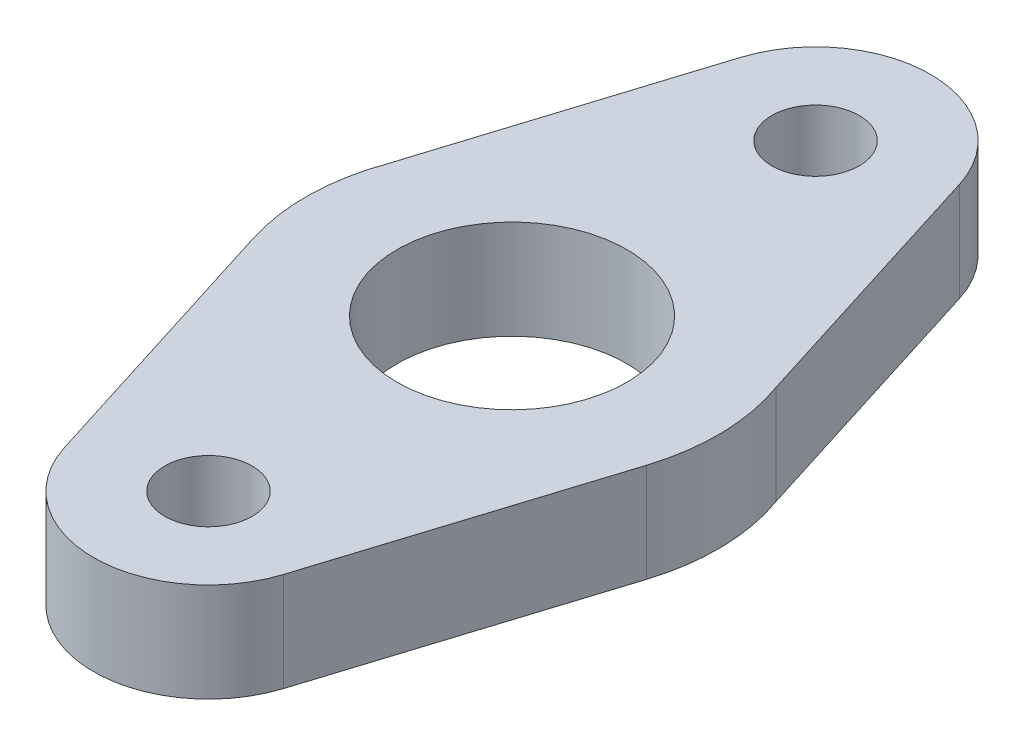
ISO-10303-21;
HEADER;
FILE_DESCRIPTION(('STEP AP214'),'2;1');
FILE_NAME('part.step','',(''),(''),'','','');
FILE_SCHEMA(('AUTOMOTIVE_DESIGN { 1 0 10303 214 1 1 1 1 }'));
ENDSEC;
DATA;
#1=APPLICATION_CONTEXT('core data for automotive mechanical design processes');
#2=APPLICATION_PROTOCOL_DEFINITION('international standard','automotive_design',2000,#1);
#3=PRODUCT_CONTEXT('',#1,'mechanical');
#4=PRODUCT('Part','Part','',(#3));
#5=PRODUCT_RELATED_PRODUCT_CATEGORY('part','',(#4));
#6=PRODUCT_DEFINITION_FORMATION('','',#4);
#7=PRODUCT_DEFINITION_CONTEXT('part definition',#1,'design');
#8=PRODUCT_DEFINITION('design','',#6,#7);
#9=PRODUCT_DEFINITION_SHAPE('','',#8);
#10=(LENGTH_UNIT() NAMED_UNIT(*) SI_UNIT(.MILLI.,.METRE.));
#11=(NAMED_UNIT(*) PLANE_ANGLE_UNIT() SI_UNIT($,.RADIAN.));
#12=(NAMED_UNIT(*) SI_UNIT($,.STERADIAN.) SOLID_ANGLE_UNIT());
#13=UNCERTAINTY_MEASURE_WITH_UNIT(LENGTH_MEASURE(1.E-05),#10,'distance_accuracy_value','');
#14=(GEOMETRIC_REPRESENTATION_CONTEXT(3) GLOBAL_UNCERTAINTY_ASSIGNED_CONTEXT((#13)) GLOBAL_UNIT_ASSIGNED_CONTEXT((#10,
#11,#12)) REPRESENTATION_CONTEXT('',''));
#15=CARTESIAN_POINT('',(0.,0.,0.));
#16=DIRECTION('',(0.,0.,1.));
#17=DIRECTION('',(1.,0.,0.));
#18=AXIS2_PLACEMENT_3D('',#15,#16,#17);
#19=CARTESIAN_POINT('',(75.7144117647058,80.772,33.528));
#20=DIRECTION('',(0.,1.,0.));
#21=DIRECTION('',(0.,0.,1.));
#22=AXIS2_PLACEMENT_3D('',#19,#20,#21);
#23=PLANE('',#22);
#24=CARTESIAN_POINT('',(75.7144117647058,80.772,-33.528));
#25=DIRECTION('',(0.,1.,0.));
#26=DIRECTION('',(0.,0.,1.));
#27=AXIS2_PLACEMENT_3D('',#24,#25,#26);
#28=CIRCLE('',#27,4.82599999999999);
#29=CARTESIAN_POINT('',(75.7144117647058,80.772,-28.702));
#30=VERTEX_POINT('',#29);
#31=EDGE_CURVE('E219',#30,#30,#28,.T.);
#32=ORIENTED_EDGE('',*,*,#31,.F.);
#33=EDGE_LOOP('',(#32));
#34=FACE_BOUND('',#33,.T.);
#35=CARTESIAN_POINT('',(75.7144117647058,80.772,33.528));
#36=DIRECTION('',(0.,1.,0.));
#37=DIRECTION('',(0.,0.,1.));
#38=AXIS2_PLACEMENT_3D('',#35,#36,#37);
#39=CIRCLE('',#38,12.7);
#40=CARTESIAN_POINT('',(63.6010012150996,80.772,37.3431389039835));
#41=VERTEX_POINT('',#40);
#42=CARTESIAN_POINT('',(87.8278223143121,80.772,37.3431389039835));
#43=VERTEX_POINT('',#42);
#44=EDGE_CURVE('E170',#41,#43,#39,.T.);
#45=ORIENTED_EDGE('',*,*,#44,.T.);
#46=DIRECTION('',(0.300404638108933,0.,-0.953811854299705));
#47=VECTOR('',#46,1.);
#48=CARTESIAN_POINT('',(87.8278223143121,80.772,37.3431389039835));
#49=LINE('',#48,#47);
#50=CARTESIAN_POINT('',(97.4345835550993,80.772,6.84080441749971));
#51=VERTEX_POINT('',#50);
#52=EDGE_CURVE('E106',#43,#51,#49,.T.);
#53=ORIENTED_EDGE('',*,*,#52,.T.);
#54=CARTESIAN_POINT('',(75.7144117647058,80.772,0.));
#55=DIRECTION('',(0.,1.,0.));
#56=DIRECTION('',(0.,0.,1.));
#57=AXIS2_PLACEMENT_3D('',#54,#55,#56);
#58=CIRCLE('',#57,22.7719667065163);
#59=CARTESIAN_POINT('',(97.1130608396016,80.772,-7.78847131676994));
#60=VERTEX_POINT('',#59);
#61=EDGE_CURVE('E191',#51,#60,#58,.T.);
#62=ORIENTED_EDGE('',*,*,#61,.T.);
#63=DIRECTION('',(-0.299727454331751,0.,-0.954024870283688));
#64=VECTOR('',#63,1.);
#65=CARTESIAN_POINT('',(97.1130608396016,80.772,-7.78847131676994));
#66=LINE('',#65,#64);
#67=CARTESIAN_POINT('',(87.8305276173087,80.772,-37.3345386700132));
#68=VERTEX_POINT('',#67);
#69=EDGE_CURVE('E205',#60,#68,#66,.T.);
#70=ORIENTED_EDGE('',*,*,#69,.T.);
#71=CARTESIAN_POINT('',(75.7144117647058,80.772,-33.528));
#72=DIRECTION('',(0.,1.,0.));
#73=DIRECTION('',(0.,0.,1.));
#74=AXIS2_PLACEMENT_3D('',#71,#72,#73);
#75=CIRCLE('',#74,12.7);
#76=CARTESIAN_POINT('',(63.598295912103,80.772,-37.3345386700132));
#77=VERTEX_POINT('',#76);
#78=EDGE_CURVE('E125',#68,#77,#75,.T.);
#79=ORIENTED_EDGE('',*,*,#78,.T.);
#80=DIRECTION('',(-0.29972745433175,0.,0.954024870283688));
#81=VECTOR('',#80,1.);
#82=CARTESIAN_POINT('',(63.598295912103,80.772,-37.3345386700132));
#83=LINE('',#82,#81);
#84=CARTESIAN_POINT('',(54.31576268981,80.772,-7.78847131676994));
#85=VERTEX_POINT('',#84);
#86=EDGE_CURVE('E119',#77,#85,#83,.T.);
#87=ORIENTED_EDGE('',*,*,#86,.T.);
#88=CARTESIAN_POINT('',(75.7144117647058,80.772,0.));
#89=DIRECTION('',(0.,1.,0.));
#90=DIRECTION('',(0.,0.,1.));
#91=AXIS2_PLACEMENT_3D('',#88,#89,#90);
#92=CIRCLE('',#91,22.7719667065163);
#93=CARTESIAN_POINT('',(53.9942399743124,80.772,6.84080441749969));
#94=VERTEX_POINT('',#93);
#95=EDGE_CURVE('E123',#85,#94,#92,.T.);
#96=ORIENTED_EDGE('',*,*,#95,.T.);
#97=DIRECTION('',(0.300404638108933,0.,0.953811854299705));
#98=VECTOR('',#97,1.);
#99=CARTESIAN_POINT('',(53.9942399743124,80.772,6.84080441749969));
#100=LINE('',#99,#98);
#101=EDGE_CURVE('E63',#94,#41,#100,.T.);
#102=ORIENTED_EDGE('',*,*,#101,.T.);
#103=EDGE_LOOP('',(#45,#53,#62,#70,#79,#87,#96,#102));
#104=FACE_BOUND('',#103,.T.);
#105=CARTESIAN_POINT('',(75.7144117647058,80.772,33.528));
#106=DIRECTION('',(0.,1.,0.));
#107=DIRECTION('',(0.,0.,1.));
#108=AXIS2_PLACEMENT_3D('',#105,#106,#107);
#109=CIRCLE('',#108,4.82599999999999);
#110=CARTESIAN_POINT('',(75.7144117647058,80.772,38.354));
#111=VERTEX_POINT('',#110);
#112=EDGE_CURVE('E152',#111,#111,#109,.T.);
#113=ORIENTED_EDGE('',*,*,#112,.F.);
#114=EDGE_LOOP('',(#113));
#115=FACE_BOUND('',#114,.T.);
#116=CARTESIAN_POINT('',(75.7144117647058,80.772,0.));
#117=DIRECTION('',(0.,1.,0.));
#118=DIRECTION('',(0.,0.,1.));
#119=AXIS2_PLACEMENT_3D('',#116,#117,#118);
#120=CIRCLE('',#119,12.7);
#121=CARTESIAN_POINT('',(75.7144117647058,80.772,12.7));
#122=VERTEX_POINT('',#121);
#123=EDGE_CURVE('E227',#122,#122,#120,.T.);
#124=ORIENTED_EDGE('',*,*,#123,.F.);
#125=EDGE_LOOP('',(#124));
#126=FACE_BOUND('',#125,.T.);
#127=ADVANCED_FACE('F45',(#34,#104,#115,#126),#23,.T.);
#128=CARTESIAN_POINT('',(75.7144117647058,69.85,33.528));
#129=DIRECTION('',(0.,1.,0.));
#130=DIRECTION('',(0.,0.,1.));
#131=AXIS2_PLACEMENT_3D('',#128,#129,#130);
#132=PLANE('',#131);
#133=CARTESIAN_POINT('',(75.7144117647058,69.85,33.528));
#134=DIRECTION('',(0.,1.,0.));
#135=DIRECTION('',(0.,0.,1.));
#136=AXIS2_PLACEMENT_3D('',#133,#134,#135);
#137=CIRCLE('',#136,12.7);
#138=CARTESIAN_POINT('',(63.6010012150996,69.85,37.3431389039835));
#139=VERTEX_POINT('',#138);
#140=CARTESIAN_POINT('',(87.8278223143121,69.85,37.3431389039835));
#141=VERTEX_POINT('',#140);
#142=EDGE_CURVE('E147',#139,#141,#137,.T.);
#143=ORIENTED_EDGE('',*,*,#142,.F.);
#144=DIRECTION('',(0.300404638108933,0.,0.953811854299705));
#145=VECTOR('',#144,1.);
#146=CARTESIAN_POINT('',(53.9942399743124,69.85,6.84080441749969));
#147=LINE('',#146,#145);
#148=CARTESIAN_POINT('',(53.9942399743124,69.85,6.84080441749969));
#149=VERTEX_POINT('',#148);
#150=EDGE_CURVE('E98',#149,#139,#147,.T.);
#151=ORIENTED_EDGE('',*,*,#150,.F.);
#152=CARTESIAN_POINT('',(75.7144117647058,69.85,0.));
#153=DIRECTION('',(0.,1.,0.));
#154=DIRECTION('',(0.,0.,1.));
#155=AXIS2_PLACEMENT_3D('',#152,#153,#154);
#156=CIRCLE('',#155,22.7719667065163);
#157=CARTESIAN_POINT('',(54.31576268981,69.85,-7.78847131676994));
#158=VERTEX_POINT('',#157);
#159=EDGE_CURVE('E92',#158,#149,#156,.T.);
#160=ORIENTED_EDGE('',*,*,#159,.F.);
#161=DIRECTION('',(-0.29972745433175,0.,0.954024870283688));
#162=VECTOR('',#161,1.);
#163=CARTESIAN_POINT('',(63.598295912103,69.85,-37.3345386700132));
#164=LINE('',#163,#162);
#165=CARTESIAN_POINT('',(63.598295912103,69.85,-37.3345386700132));
#166=VERTEX_POINT('',#165);
#167=EDGE_CURVE('E134',#166,#158,#164,.T.);
#168=ORIENTED_EDGE('',*,*,#167,.F.);
#169=CARTESIAN_POINT('',(75.7144117647058,69.85,-33.528));
#170=DIRECTION('',(0.,1.,0.));
#171=DIRECTION('',(0.,0.,1.));
#172=AXIS2_PLACEMENT_3D('',#169,#170,#171);
#173=CIRCLE('',#172,12.7);
#174=CARTESIAN_POINT('',(87.8305276173087,69.85,-37.3345386700132));
#175=VERTEX_POINT('',#174);
#176=EDGE_CURVE('E161',#175,#166,#173,.T.);
#177=ORIENTED_EDGE('',*,*,#176,.F.);
#178=DIRECTION('',(-0.299727454331751,0.,-0.954024870283688));
#179=VECTOR('',#178,1.);
#180=CARTESIAN_POINT('',(97.1130608396016,69.85,-7.78847131676994));
#181=LINE('',#180,#179);
#182=CARTESIAN_POINT('',(97.1130608396016,69.85,-7.78847131676994));
#183=VERTEX_POINT('',#182);
#184=EDGE_CURVE('E158',#183,#175,#181,.T.);
#185=ORIENTED_EDGE('',*,*,#184,.F.);
#186=CARTESIAN_POINT('',(75.7144117647058,69.85,0.));
#187=DIRECTION('',(0.,1.,0.));
#188=DIRECTION('',(0.,0.,1.));
#189=AXIS2_PLACEMENT_3D('',#186,#187,#188);
#190=CIRCLE('',#189,22.7719667065163);
#191=CARTESIAN_POINT('',(97.4345835550993,69.85,6.84080441749971));
#192=VERTEX_POINT('',#191);
#193=EDGE_CURVE('E155',#192,#183,#190,.T.);
#194=ORIENTED_EDGE('',*,*,#193,.F.);
#195=DIRECTION('',(0.300404638108933,0.,-0.953811854299705));
#196=VECTOR('',#195,1.);
#197=CARTESIAN_POINT('',(87.8278223143121,69.85,37.3431389039835));
#198=LINE('',#197,#196);
#199=EDGE_CURVE('E151',#141,#192,#198,.T.);
#200=ORIENTED_EDGE('',*,*,#199,.F.);
#201=EDGE_LOOP('',(#143,#151,#160,#168,#177,#185,#194,#200));
#202=FACE_BOUND('',#201,.T.);
#203=CARTESIAN_POINT('',(75.7144117647058,69.85,33.528));
#204=DIRECTION('',(0.,1.,0.));
#205=DIRECTION('',(0.,0.,1.));
#206=AXIS2_PLACEMENT_3D('',#203,#204,#205);
#207=CIRCLE('',#206,4.82599999999999);
#208=CARTESIAN_POINT('',(75.7144117647058,69.85,38.354));
#209=VERTEX_POINT('',#208);
#210=EDGE_CURVE('E215',#209,#209,#207,.T.);
#211=ORIENTED_EDGE('',*,*,#210,.T.);
#212=EDGE_LOOP('',(#211));
#213=FACE_BOUND('',#212,.T.);
#214=CARTESIAN_POINT('',(75.7144117647058,69.85,-33.528));
#215=DIRECTION('',(0.,1.,0.));
#216=DIRECTION('',(0.,0.,1.));
#217=AXIS2_PLACEMENT_3D('',#214,#215,#216);
#218=CIRCLE('',#217,4.82599999999999);
#219=CARTESIAN_POINT('',(75.7144117647058,69.85,-28.702));
#220=VERTEX_POINT('',#219);
#221=EDGE_CURVE('E223',#220,#220,#218,.T.);
#222=ORIENTED_EDGE('',*,*,#221,.T.);
#223=EDGE_LOOP('',(#222));
#224=FACE_BOUND('',#223,.T.);
#225=CARTESIAN_POINT('',(75.7144117647058,69.85,0.));
#226=DIRECTION('',(0.,1.,0.));
#227=DIRECTION('',(0.,0.,1.));
#228=AXIS2_PLACEMENT_3D('',#225,#226,#227);
#229=CIRCLE('',#228,12.7);
#230=CARTESIAN_POINT('',(75.7144117647058,69.85,12.7));
#231=VERTEX_POINT('',#230);
#232=EDGE_CURVE('E231',#231,#231,#229,.T.);
#233=ORIENTED_EDGE('',*,*,#232,.T.);
#234=EDGE_LOOP('',(#233));
#235=FACE_BOUND('',#234,.T.);
#236=ADVANCED_FACE('F195',(#202,#213,#224,#235),#132,.F.);
#237=CARTESIAN_POINT('',(75.7144117647058,80.772,33.528));
#238=DIRECTION('',(0.,-1.,0.));
#239=DIRECTION('',(0.,0.,-1.));
#240=AXIS2_PLACEMENT_3D('',#237,#238,#239);
#241=CYLINDRICAL_SURFACE('',#240,12.7);
#242=ORIENTED_EDGE('',*,*,#142,.T.);
#243=DIRECTION('',(0.,-1.,0.));
#244=VECTOR('',#243,1.);
#245=CARTESIAN_POINT('',(87.8278223143121,80.772,37.3431389039835));
#246=LINE('',#245,#244);
#247=EDGE_CURVE('E11',#43,#141,#246,.T.);
#248=ORIENTED_EDGE('',*,*,#247,.F.);
#249=ORIENTED_EDGE('',*,*,#44,.F.);
#250=DIRECTION('',(0.,-1.,0.));
#251=VECTOR('',#250,1.);
#252=CARTESIAN_POINT('',(63.6010012150996,80.772,37.3431389039835));
#253=LINE('',#252,#251);
#254=EDGE_CURVE('E143',#41,#139,#253,.T.);
#255=ORIENTED_EDGE('',*,*,#254,.T.);
#256=EDGE_LOOP('',(#242,#248,#249,#255));
#257=FACE_BOUND('',#256,.T.);
#258=ADVANCED_FACE('F47',(#257),#241,.T.);
#259=CARTESIAN_POINT('',(87.8278223143121,80.772,37.3431389039835));
#260=DIRECTION('',(-0.953811854299705,0.,-0.300404638108933));
#261=DIRECTION('',(-0.300404638108933,0.,0.953811854299705));
#262=AXIS2_PLACEMENT_3D('',#259,#260,#261);
#263=PLANE('',#262);
#264=ORIENTED_EDGE('',*,*,#199,.T.);
#265=DIRECTION('',(0.,-1.,0.));
#266=VECTOR('',#265,1.);
#267=CARTESIAN_POINT('',(97.4345835550993,80.772,6.84080441749971));
#268=LINE('',#267,#266);
#269=EDGE_CURVE('E55',#51,#192,#268,.T.);
#270=ORIENTED_EDGE('',*,*,#269,.F.);
#271=ORIENTED_EDGE('',*,*,#52,.F.);
#272=ORIENTED_EDGE('',*,*,#247,.T.);
#273=EDGE_LOOP('',(#264,#270,#271,#272));
#274=FACE_BOUND('',#273,.T.);
#275=ADVANCED_FACE('F266',(#274),#263,.F.);
#276=CARTESIAN_POINT('',(75.7144117647058,80.772,0.));
#277=DIRECTION('',(0.,-1.,0.));
#278=DIRECTION('',(0.,0.,-1.));
#279=AXIS2_PLACEMENT_3D('',#276,#277,#278);
#280=CYLINDRICAL_SURFACE('',#279,22.7719667065163);
#281=ORIENTED_EDGE('',*,*,#193,.T.);
#282=DIRECTION('',(0.,-1.,0.));
#283=VECTOR('',#282,1.);
#284=CARTESIAN_POINT('',(97.1130608396016,80.772,-7.78847131676994));
#285=LINE('',#284,#283);
#286=EDGE_CURVE('E181',#60,#183,#285,.T.);
#287=ORIENTED_EDGE('',*,*,#286,.F.);
#288=ORIENTED_EDGE('',*,*,#61,.F.);
#289=ORIENTED_EDGE('',*,*,#269,.T.);
#290=EDGE_LOOP('',(#281,#287,#288,#289));
#291=FACE_BOUND('',#290,.T.);
#292=ADVANCED_FACE('F189',(#291),#280,.T.);
#293=CARTESIAN_POINT('',(97.1130608396016,80.772,-7.78847131676994));
#294=DIRECTION('',(-0.954024870283688,0.,0.299727454331751));
#295=DIRECTION('',(0.299727454331751,0.,0.954024870283688));
#296=AXIS2_PLACEMENT_3D('',#293,#294,#295);
#297=PLANE('',#296);
#298=ORIENTED_EDGE('',*,*,#184,.T.);
#299=DIRECTION('',(0.,-1.,0.));
#300=VECTOR('',#299,1.);
#301=CARTESIAN_POINT('',(87.8305276173087,80.772,-37.3345386700132));
#302=LINE('',#301,#300);
#303=EDGE_CURVE('E177',#68,#175,#302,.T.);
#304=ORIENTED_EDGE('',*,*,#303,.F.);
#305=ORIENTED_EDGE('',*,*,#69,.F.);
#306=ORIENTED_EDGE('',*,*,#286,.T.);
#307=EDGE_LOOP('',(#298,#304,#305,#306));
#308=FACE_BOUND('',#307,.T.);
#309=ADVANCED_FACE('F200',(#308),#297,.F.);
#310=CARTESIAN_POINT('',(75.7144117647058,80.772,-33.528));
#311=DIRECTION('',(0.,-1.,0.));
#312=DIRECTION('',(0.,0.,-1.));
#313=AXIS2_PLACEMENT_3D('',#310,#311,#312);
#314=CYLINDRICAL_SURFACE('',#313,12.7);
#315=ORIENTED_EDGE('',*,*,#176,.T.);
#316=DIRECTION('',(0.,-1.,0.));
#317=VECTOR('',#316,1.);
#318=CARTESIAN_POINT('',(63.598295912103,80.772,-37.3345386700132));
#319=LINE('',#318,#317);
#320=EDGE_CURVE('E136',#77,#166,#319,.T.);
#321=ORIENTED_EDGE('',*,*,#320,.F.);
#322=ORIENTED_EDGE('',*,*,#78,.F.);
#323=ORIENTED_EDGE('',*,*,#303,.T.);
#324=EDGE_LOOP('',(#315,#321,#322,#323));
#325=FACE_BOUND('',#324,.T.);
#326=ADVANCED_FACE('F203',(#325),#314,.T.);
#327=CARTESIAN_POINT('',(63.598295912103,80.772,-37.3345386700132));
#328=DIRECTION('',(0.954024870283688,0.,0.29972745433175));
#329=DIRECTION('',(0.29972745433175,0.,-0.954024870283688));
#330=AXIS2_PLACEMENT_3D('',#327,#328,#329);
#331=PLANE('',#330);
#332=ORIENTED_EDGE('',*,*,#167,.T.);
#333=DIRECTION('',(0.,-1.,0.));
#334=VECTOR('',#333,1.);
#335=CARTESIAN_POINT('',(54.31576268981,80.772,-7.78847131676994));
#336=LINE('',#335,#334);
#337=EDGE_CURVE('E131',#85,#158,#336,.T.);
#338=ORIENTED_EDGE('',*,*,#337,.F.);
#339=ORIENTED_EDGE('',*,*,#86,.F.);
#340=ORIENTED_EDGE('',*,*,#320,.T.);
#341=EDGE_LOOP('',(#332,#338,#339,#340));
#342=FACE_BOUND('',#341,.T.);
#343=ADVANCED_FACE('F132',(#342),#331,.F.);
#344=CARTESIAN_POINT('',(75.7144117647058,80.772,0.));
#345=DIRECTION('',(0.,-1.,0.));
#346=DIRECTION('',(0.,0.,-1.));
#347=AXIS2_PLACEMENT_3D('',#344,#345,#346);
#348=CYLINDRICAL_SURFACE('',#347,22.7719667065163);
#349=ORIENTED_EDGE('',*,*,#159,.T.);
#350=DIRECTION('',(0.,-1.,0.));
#351=VECTOR('',#350,1.);
#352=CARTESIAN_POINT('',(53.9942399743124,80.772,6.84080441749969));
#353=LINE('',#352,#351);
#354=EDGE_CURVE('E137',#94,#149,#353,.T.);
#355=ORIENTED_EDGE('',*,*,#354,.F.);
#356=ORIENTED_EDGE('',*,*,#95,.F.);
#357=ORIENTED_EDGE('',*,*,#337,.T.);
#358=EDGE_LOOP('',(#349,#355,#356,#357));
#359=FACE_BOUND('',#358,.T.);
#360=ADVANCED_FACE('F139',(#359),#348,.T.);
#361=CARTESIAN_POINT('',(53.9942399743124,80.772,6.84080441749969));
#362=DIRECTION('',(0.953811854299705,0.,-0.300404638108933));
#363=DIRECTION('',(-0.300404638108933,0.,-0.953811854299705));
#364=AXIS2_PLACEMENT_3D('',#361,#362,#363);
#365=PLANE('',#364);
#366=ORIENTED_EDGE('',*,*,#150,.T.);
#367=ORIENTED_EDGE('',*,*,#254,.F.);
#368=ORIENTED_EDGE('',*,*,#101,.F.);
#369=ORIENTED_EDGE('',*,*,#354,.T.);
#370=EDGE_LOOP('',(#366,#367,#368,#369));
#371=FACE_BOUND('',#370,.T.);
#372=ADVANCED_FACE('F254',(#371),#365,.F.);
#373=CARTESIAN_POINT('',(75.7144117647058,80.772,33.528));
#374=DIRECTION('',(0.,-1.,0.));
#375=DIRECTION('',(0.,0.,-1.));
#376=AXIS2_PLACEMENT_3D('',#373,#374,#375);
#377=CYLINDRICAL_SURFACE('',#376,4.82599999999999);
#378=ORIENTED_EDGE('',*,*,#112,.T.);
#379=EDGE_LOOP('',(#378));
#380=FACE_BOUND('',#379,.T.);
#381=ORIENTED_EDGE('',*,*,#210,.F.);
#382=EDGE_LOOP('',(#381));
#383=FACE_BOUND('',#382,.T.);
#384=ADVANCED_FACE('F251',(#380,#383),#377,.F.);
#385=CARTESIAN_POINT('',(75.7144117647058,80.772,-33.528));
#386=DIRECTION('',(0.,-1.,0.));
#387=DIRECTION('',(0.,0.,-1.));
#388=AXIS2_PLACEMENT_3D('',#385,#386,#387);
#389=CYLINDRICAL_SURFACE('',#388,4.82599999999999);
#390=ORIENTED_EDGE('',*,*,#31,.T.);
#391=EDGE_LOOP('',(#390));
#392=FACE_BOUND('',#391,.T.);
#393=ORIENTED_EDGE('',*,*,#221,.F.);
#394=EDGE_LOOP('',(#393));
#395=FACE_BOUND('',#394,.T.);
#396=ADVANCED_FACE('F330',(#392,#395),#389,.F.);
#397=CARTESIAN_POINT('',(75.7144117647058,80.772,0.));
#398=DIRECTION('',(0.,-1.,0.));
#399=DIRECTION('',(0.,0.,-1.));
#400=AXIS2_PLACEMENT_3D('',#397,#398,#399);
#401=CYLINDRICAL_SURFACE('',#400,12.7);
#402=ORIENTED_EDGE('',*,*,#123,.T.);
#403=EDGE_LOOP('',(#402));
#404=FACE_BOUND('',#403,.T.);
#405=ORIENTED_EDGE('',*,*,#232,.F.);
#406=EDGE_LOOP('',(#405));
#407=FACE_BOUND('',#406,.T.);
#408=ADVANCED_FACE('F239',(#404,#407),#401,.F.);
#409=CLOSED_SHELL('',(#127,#236,#258,#275,#292,#309,#326,#343,#360,#372,#384,#396,#408));
#410=MANIFOLD_SOLID_BREP('B2',#409);
#411=ADVANCED_BREP_SHAPE_REPRESENTATION('',(#18,#410),#14);
#412=SHAPE_DEFINITION_REPRESENTATION(#9,#411);
ENDSEC;
END-ISO-10303-21;
